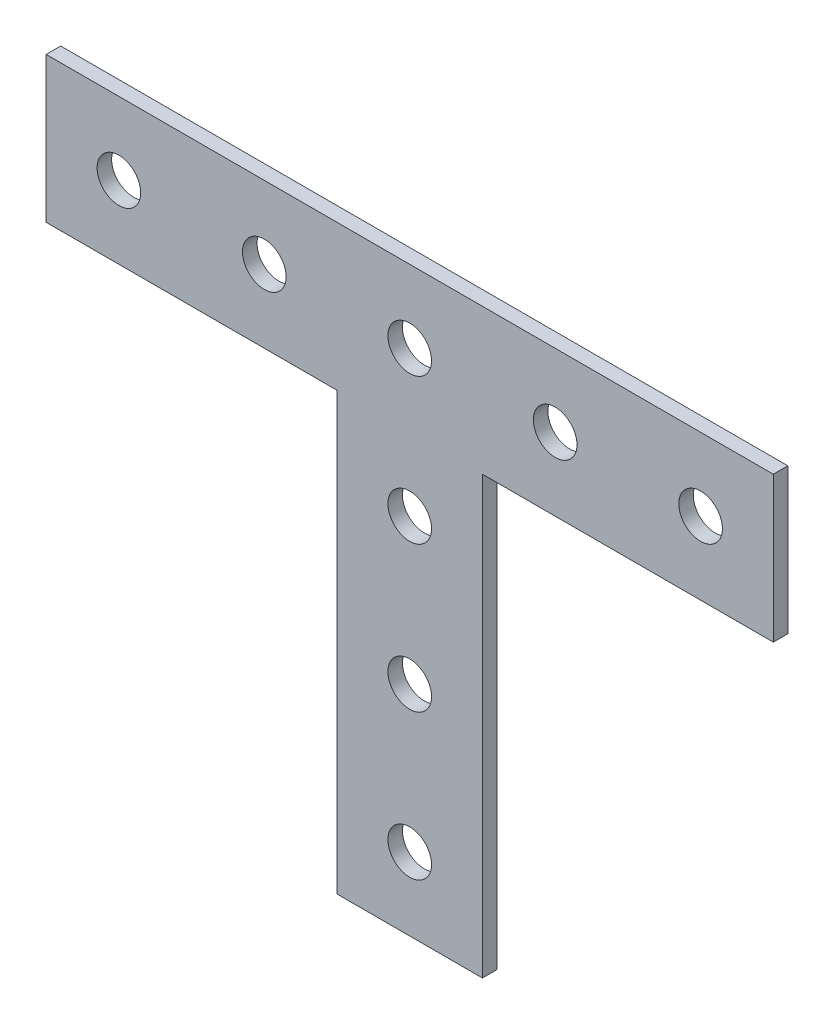
ISO-10303-21;
HEADER;
FILE_DESCRIPTION(('STEP AP214'),'2;1');
FILE_NAME('part.step','',(''),(''),'','','');
FILE_SCHEMA(('AUTOMOTIVE_DESIGN { 1 0 10303 214 1 1 1 1 }'));
ENDSEC;
DATA;
#1=APPLICATION_CONTEXT('core data for automotive mechanical design processes');
#2=APPLICATION_PROTOCOL_DEFINITION('international standard','automotive_design',2000,#1);
#3=PRODUCT_CONTEXT('',#1,'mechanical');
#4=PRODUCT('Part','Part','',(#3));
#5=PRODUCT_RELATED_PRODUCT_CATEGORY('part','',(#4));
#6=PRODUCT_DEFINITION_FORMATION('','',#4);
#7=PRODUCT_DEFINITION_CONTEXT('part definition',#1,'design');
#8=PRODUCT_DEFINITION('design','',#6,#7);
#9=PRODUCT_DEFINITION_SHAPE('','',#8);
#10=(LENGTH_UNIT() NAMED_UNIT(*) SI_UNIT(.MILLI.,.METRE.));
#11=(NAMED_UNIT(*) PLANE_ANGLE_UNIT() SI_UNIT($,.RADIAN.));
#12=(NAMED_UNIT(*) SI_UNIT($,.STERADIAN.) SOLID_ANGLE_UNIT());
#13=UNCERTAINTY_MEASURE_WITH_UNIT(LENGTH_MEASURE(1.E-05),#10,'distance_accuracy_value','');
#14=(GEOMETRIC_REPRESENTATION_CONTEXT(3) GLOBAL_UNCERTAINTY_ASSIGNED_CONTEXT((#13)) GLOBAL_UNIT_ASSIGNED_CONTEXT((#10,
#11,#12)) REPRESENTATION_CONTEXT('',''));
#15=CARTESIAN_POINT('',(0.,0.,0.));
#16=DIRECTION('',(0.,0.,1.));
#17=DIRECTION('',(1.,0.,0.));
#18=AXIS2_PLACEMENT_3D('',#15,#16,#17);
#19=CARTESIAN_POINT('',(0.,-25.,0.));
#20=DIRECTION('',(0.,0.,1.));
#21=DIRECTION('',(1.,0.,0.));
#22=AXIS2_PLACEMENT_3D('',#19,#20,#21);
#23=CYLINDRICAL_SURFACE('',#22,1.5);
#24=CARTESIAN_POINT('',(0.,-25.,0.));
#25=DIRECTION('',(0.,0.,1.));
#26=DIRECTION('',(1.,0.,0.));
#27=AXIS2_PLACEMENT_3D('',#24,#25,#26);
#28=CIRCLE('',#27,1.5);
#29=CARTESIAN_POINT('',(1.5,-25.,0.));
#30=VERTEX_POINT('',#29);
#31=EDGE_CURVE('E41',#30,#30,#28,.T.);
#32=ORIENTED_EDGE('',*,*,#31,.F.);
#33=EDGE_LOOP('',(#32));
#34=FACE_BOUND('',#33,.T.);
#35=CARTESIAN_POINT('',(0.,-25.,1.));
#36=DIRECTION('',(0.,0.,1.));
#37=DIRECTION('',(1.,0.,0.));
#38=AXIS2_PLACEMENT_3D('',#35,#36,#37);
#39=CIRCLE('',#38,1.5);
#40=CARTESIAN_POINT('',(1.5,-25.,1.));
#41=VERTEX_POINT('',#40);
#42=EDGE_CURVE('E11',#41,#41,#39,.T.);
#43=ORIENTED_EDGE('',*,*,#42,.T.);
#44=EDGE_LOOP('',(#43));
#45=FACE_BOUND('',#44,.T.);
#46=ADVANCED_FACE('F33',(#34,#45),#23,.F.);
#47=CARTESIAN_POINT('',(0.,-15.,0.));
#48=DIRECTION('',(0.,0.,1.));
#49=DIRECTION('',(1.,0.,0.));
#50=AXIS2_PLACEMENT_3D('',#47,#48,#49);
#51=CYLINDRICAL_SURFACE('',#50,1.5);
#52=CARTESIAN_POINT('',(0.,-15.,0.));
#53=DIRECTION('',(0.,0.,1.));
#54=DIRECTION('',(1.,0.,0.));
#55=AXIS2_PLACEMENT_3D('',#52,#53,#54);
#56=CIRCLE('',#55,1.5);
#57=CARTESIAN_POINT('',(1.5,-15.,0.));
#58=VERTEX_POINT('',#57);
#59=EDGE_CURVE('E173',#58,#58,#56,.T.);
#60=ORIENTED_EDGE('',*,*,#59,.F.);
#61=EDGE_LOOP('',(#60));
#62=FACE_BOUND('',#61,.T.);
#63=CARTESIAN_POINT('',(0.,-15.,1.));
#64=DIRECTION('',(0.,0.,1.));
#65=DIRECTION('',(1.,0.,0.));
#66=AXIS2_PLACEMENT_3D('',#63,#64,#65);
#67=CIRCLE('',#66,1.5);
#68=CARTESIAN_POINT('',(1.5,-15.,1.));
#69=VERTEX_POINT('',#68);
#70=EDGE_CURVE('E176',#69,#69,#67,.T.);
#71=ORIENTED_EDGE('',*,*,#70,.T.);
#72=EDGE_LOOP('',(#71));
#73=FACE_BOUND('',#72,.T.);
#74=ADVANCED_FACE('F185',(#62,#73),#51,.F.);
#75=CARTESIAN_POINT('',(20.,5.,0.));
#76=DIRECTION('',(0.,0.,1.));
#77=DIRECTION('',(1.,0.,0.));
#78=AXIS2_PLACEMENT_3D('',#75,#76,#77);
#79=CYLINDRICAL_SURFACE('',#78,1.5);
#80=CARTESIAN_POINT('',(20.,5.,0.));
#81=DIRECTION('',(0.,0.,1.));
#82=DIRECTION('',(1.,0.,0.));
#83=AXIS2_PLACEMENT_3D('',#80,#81,#82);
#84=CIRCLE('',#83,1.5);
#85=CARTESIAN_POINT('',(21.5,5.,0.));
#86=VERTEX_POINT('',#85);
#87=EDGE_CURVE('E167',#86,#86,#84,.T.);
#88=ORIENTED_EDGE('',*,*,#87,.F.);
#89=EDGE_LOOP('',(#88));
#90=FACE_BOUND('',#89,.T.);
#91=CARTESIAN_POINT('',(20.,5.,1.));
#92=DIRECTION('',(0.,0.,1.));
#93=DIRECTION('',(1.,0.,0.));
#94=AXIS2_PLACEMENT_3D('',#91,#92,#93);
#95=CIRCLE('',#94,1.5);
#96=CARTESIAN_POINT('',(21.5,5.,1.));
#97=VERTEX_POINT('',#96);
#98=EDGE_CURVE('E170',#97,#97,#95,.T.);
#99=ORIENTED_EDGE('',*,*,#98,.T.);
#100=EDGE_LOOP('',(#99));
#101=FACE_BOUND('',#100,.T.);
#102=ADVANCED_FACE('F231',(#90,#101),#79,.F.);
#103=CARTESIAN_POINT('',(-20.,5.,0.));
#104=DIRECTION('',(0.,0.,1.));
#105=DIRECTION('',(1.,0.,0.));
#106=AXIS2_PLACEMENT_3D('',#103,#104,#105);
#107=CYLINDRICAL_SURFACE('',#106,1.5);
#108=CARTESIAN_POINT('',(-20.,5.,0.));
#109=DIRECTION('',(0.,0.,1.));
#110=DIRECTION('',(1.,0.,0.));
#111=AXIS2_PLACEMENT_3D('',#108,#109,#110);
#112=CIRCLE('',#111,1.5);
#113=CARTESIAN_POINT('',(-18.5,5.,0.));
#114=VERTEX_POINT('',#113);
#115=EDGE_CURVE('E161',#114,#114,#112,.T.);
#116=ORIENTED_EDGE('',*,*,#115,.F.);
#117=EDGE_LOOP('',(#116));
#118=FACE_BOUND('',#117,.T.);
#119=CARTESIAN_POINT('',(-20.,5.,1.));
#120=DIRECTION('',(0.,0.,1.));
#121=DIRECTION('',(1.,0.,0.));
#122=AXIS2_PLACEMENT_3D('',#119,#120,#121);
#123=CIRCLE('',#122,1.5);
#124=CARTESIAN_POINT('',(-18.5,5.,1.));
#125=VERTEX_POINT('',#124);
#126=EDGE_CURVE('E164',#125,#125,#123,.T.);
#127=ORIENTED_EDGE('',*,*,#126,.T.);
#128=EDGE_LOOP('',(#127));
#129=FACE_BOUND('',#128,.T.);
#130=ADVANCED_FACE('F227',(#118,#129),#107,.F.);
#131=CARTESIAN_POINT('',(-25.,0.,1.));
#132=DIRECTION('',(1.,0.,0.));
#133=DIRECTION('',(0.,0.,-1.));
#134=AXIS2_PLACEMENT_3D('',#131,#132,#133);
#135=PLANE('',#134);
#136=DIRECTION('',(0.,-1.,0.));
#137=VECTOR('',#136,1.);
#138=CARTESIAN_POINT('',(-25.,0.,0.));
#139=LINE('',#138,#137);
#140=CARTESIAN_POINT('',(-25.,10.,0.));
#141=VERTEX_POINT('',#140);
#142=CARTESIAN_POINT('',(-25.,0.,0.));
#143=VERTEX_POINT('',#142);
#144=EDGE_CURVE('E131',#141,#143,#139,.T.);
#145=ORIENTED_EDGE('',*,*,#144,.T.);
#146=DIRECTION('',(0.,0.,-1.));
#147=VECTOR('',#146,1.);
#148=CARTESIAN_POINT('',(-25.,0.,1.));
#149=LINE('',#148,#147);
#150=CARTESIAN_POINT('',(-25.,0.,1.));
#151=VERTEX_POINT('',#150);
#152=EDGE_CURVE('E159',#151,#143,#149,.T.);
#153=ORIENTED_EDGE('',*,*,#152,.F.);
#154=DIRECTION('',(0.,-1.,0.));
#155=VECTOR('',#154,1.);
#156=CARTESIAN_POINT('',(-25.,0.,1.));
#157=LINE('',#156,#155);
#158=CARTESIAN_POINT('',(-25.,10.,1.));
#159=VERTEX_POINT('',#158);
#160=EDGE_CURVE('E146',#159,#151,#157,.T.);
#161=ORIENTED_EDGE('',*,*,#160,.F.);
#162=DIRECTION('',(0.,0.,-1.));
#163=VECTOR('',#162,1.);
#164=CARTESIAN_POINT('',(-25.,10.,1.));
#165=LINE('',#164,#163);
#166=EDGE_CURVE('E127',#159,#141,#165,.T.);
#167=ORIENTED_EDGE('',*,*,#166,.T.);
#168=EDGE_LOOP('',(#145,#153,#161,#167));
#169=FACE_BOUND('',#168,.T.);
#170=ADVANCED_FACE('F224',(#169),#135,.F.);
#171=CARTESIAN_POINT('',(-5.,0.,1.));
#172=DIRECTION('',(0.,1.,0.));
#173=DIRECTION('',(-1.,0.,0.));
#174=AXIS2_PLACEMENT_3D('',#171,#172,#173);
#175=PLANE('',#174);
#176=DIRECTION('',(1.,0.,0.));
#177=VECTOR('',#176,1.);
#178=CARTESIAN_POINT('',(-5.,0.,0.));
#179=LINE('',#178,#177);
#180=CARTESIAN_POINT('',(-5.,0.,0.));
#181=VERTEX_POINT('',#180);
#182=EDGE_CURVE('E134',#143,#181,#179,.T.);
#183=ORIENTED_EDGE('',*,*,#182,.T.);
#184=DIRECTION('',(0.,0.,-1.));
#185=VECTOR('',#184,1.);
#186=CARTESIAN_POINT('',(-5.,0.,1.));
#187=LINE('',#186,#185);
#188=CARTESIAN_POINT('',(-5.,0.,1.));
#189=VERTEX_POINT('',#188);
#190=EDGE_CURVE('E156',#189,#181,#187,.T.);
#191=ORIENTED_EDGE('',*,*,#190,.F.);
#192=DIRECTION('',(1.,0.,0.));
#193=VECTOR('',#192,1.);
#194=CARTESIAN_POINT('',(-5.,0.,1.));
#195=LINE('',#194,#193);
#196=EDGE_CURVE('E93',#151,#189,#195,.T.);
#197=ORIENTED_EDGE('',*,*,#196,.F.);
#198=ORIENTED_EDGE('',*,*,#152,.T.);
#199=EDGE_LOOP('',(#183,#191,#197,#198));
#200=FACE_BOUND('',#199,.T.);
#201=ADVANCED_FACE('F220',(#200),#175,.F.);
#202=CARTESIAN_POINT('',(-5.,-30.,1.));
#203=DIRECTION('',(1.,0.,0.));
#204=DIRECTION('',(0.,0.,-1.));
#205=AXIS2_PLACEMENT_3D('',#202,#203,#204);
#206=PLANE('',#205);
#207=DIRECTION('',(0.,-1.,0.));
#208=VECTOR('',#207,1.);
#209=CARTESIAN_POINT('',(-5.,-30.,0.));
#210=LINE('',#209,#208);
#211=CARTESIAN_POINT('',(-5.,-30.,0.));
#212=VERTEX_POINT('',#211);
#213=EDGE_CURVE('E137',#181,#212,#210,.T.);
#214=ORIENTED_EDGE('',*,*,#213,.T.);
#215=DIRECTION('',(0.,0.,-1.));
#216=VECTOR('',#215,1.);
#217=CARTESIAN_POINT('',(-5.,-30.,1.));
#218=LINE('',#217,#216);
#219=CARTESIAN_POINT('',(-5.,-30.,1.));
#220=VERTEX_POINT('',#219);
#221=EDGE_CURVE('E153',#220,#212,#218,.T.);
#222=ORIENTED_EDGE('',*,*,#221,.F.);
#223=DIRECTION('',(0.,-1.,0.));
#224=VECTOR('',#223,1.);
#225=CARTESIAN_POINT('',(-5.,-30.,1.));
#226=LINE('',#225,#224);
#227=EDGE_CURVE('E375',#189,#220,#226,.T.);
#228=ORIENTED_EDGE('',*,*,#227,.F.);
#229=ORIENTED_EDGE('',*,*,#190,.T.);
#230=EDGE_LOOP('',(#214,#222,#228,#229));
#231=FACE_BOUND('',#230,.T.);
#232=ADVANCED_FACE('F216',(#231),#206,.F.);
#233=CARTESIAN_POINT('',(5.,-30.,1.));
#234=DIRECTION('',(0.,1.,0.));
#235=DIRECTION('',(0.,0.,1.));
#236=AXIS2_PLACEMENT_3D('',#233,#234,#235);
#237=PLANE('',#236);
#238=DIRECTION('',(1.,0.,0.));
#239=VECTOR('',#238,1.);
#240=CARTESIAN_POINT('',(5.,-30.,0.));
#241=LINE('',#240,#239);
#242=CARTESIAN_POINT('',(5.,-30.,0.));
#243=VERTEX_POINT('',#242);
#244=EDGE_CURVE('E139',#212,#243,#241,.T.);
#245=ORIENTED_EDGE('',*,*,#244,.T.);
#246=DIRECTION('',(0.,0.,-1.));
#247=VECTOR('',#246,1.);
#248=CARTESIAN_POINT('',(5.,-30.,1.));
#249=LINE('',#248,#247);
#250=CARTESIAN_POINT('',(5.,-30.,1.));
#251=VERTEX_POINT('',#250);
#252=EDGE_CURVE('E150',#251,#243,#249,.T.);
#253=ORIENTED_EDGE('',*,*,#252,.F.);
#254=DIRECTION('',(1.,0.,0.));
#255=VECTOR('',#254,1.);
#256=CARTESIAN_POINT('',(5.,-30.,1.));
#257=LINE('',#256,#255);
#258=EDGE_CURVE('E377',#220,#251,#257,.T.);
#259=ORIENTED_EDGE('',*,*,#258,.F.);
#260=ORIENTED_EDGE('',*,*,#221,.T.);
#261=EDGE_LOOP('',(#245,#253,#259,#260));
#262=FACE_BOUND('',#261,.T.);
#263=ADVANCED_FACE('F212',(#262),#237,.F.);
#264=CARTESIAN_POINT('',(5.,0.,1.));
#265=DIRECTION('',(-1.,0.,0.));
#266=DIRECTION('',(0.,0.,1.));
#267=AXIS2_PLACEMENT_3D('',#264,#265,#266);
#268=PLANE('',#267);
#269=DIRECTION('',(0.,1.,0.));
#270=VECTOR('',#269,1.);
#271=CARTESIAN_POINT('',(5.,0.,0.));
#272=LINE('',#271,#270);
#273=CARTESIAN_POINT('',(5.,0.,0.));
#274=VERTEX_POINT('',#273);
#275=EDGE_CURVE('E141',#243,#274,#272,.T.);
#276=ORIENTED_EDGE('',*,*,#275,.T.);
#277=DIRECTION('',(0.,0.,-1.));
#278=VECTOR('',#277,1.);
#279=CARTESIAN_POINT('',(5.,0.,1.));
#280=LINE('',#279,#278);
#281=CARTESIAN_POINT('',(5.,0.,1.));
#282=VERTEX_POINT('',#281);
#283=EDGE_CURVE('E122',#282,#274,#280,.T.);
#284=ORIENTED_EDGE('',*,*,#283,.F.);
#285=DIRECTION('',(0.,1.,0.));
#286=VECTOR('',#285,1.);
#287=CARTESIAN_POINT('',(5.,0.,1.));
#288=LINE('',#287,#286);
#289=EDGE_CURVE('E113',#251,#282,#288,.T.);
#290=ORIENTED_EDGE('',*,*,#289,.F.);
#291=ORIENTED_EDGE('',*,*,#252,.T.);
#292=EDGE_LOOP('',(#276,#284,#290,#291));
#293=FACE_BOUND('',#292,.T.);
#294=ADVANCED_FACE('F209',(#293),#268,.F.);
#295=CARTESIAN_POINT('',(25.,0.,1.));
#296=DIRECTION('',(0.,1.,0.));
#297=DIRECTION('',(-1.,0.,0.));
#298=AXIS2_PLACEMENT_3D('',#295,#296,#297);
#299=PLANE('',#298);
#300=DIRECTION('',(1.,0.,0.));
#301=VECTOR('',#300,1.);
#302=CARTESIAN_POINT('',(25.,0.,0.));
#303=LINE('',#302,#301);
#304=CARTESIAN_POINT('',(25.,0.,0.));
#305=VERTEX_POINT('',#304);
#306=EDGE_CURVE('E121',#274,#305,#303,.T.);
#307=ORIENTED_EDGE('',*,*,#306,.T.);
#308=DIRECTION('',(0.,0.,-1.));
#309=VECTOR('',#308,1.);
#310=CARTESIAN_POINT('',(25.,0.,1.));
#311=LINE('',#310,#309);
#312=CARTESIAN_POINT('',(25.,0.,1.));
#313=VERTEX_POINT('',#312);
#314=EDGE_CURVE('E118',#313,#305,#311,.T.);
#315=ORIENTED_EDGE('',*,*,#314,.F.);
#316=DIRECTION('',(1.,0.,0.));
#317=VECTOR('',#316,1.);
#318=CARTESIAN_POINT('',(25.,0.,1.));
#319=LINE('',#318,#317);
#320=EDGE_CURVE('E106',#282,#313,#319,.T.);
#321=ORIENTED_EDGE('',*,*,#320,.F.);
#322=ORIENTED_EDGE('',*,*,#283,.T.);
#323=EDGE_LOOP('',(#307,#315,#321,#322));
#324=FACE_BOUND('',#323,.T.);
#325=ADVANCED_FACE('F119',(#324),#299,.F.);
#326=CARTESIAN_POINT('',(25.,10.,1.));
#327=DIRECTION('',(-1.,0.,0.));
#328=DIRECTION('',(0.,0.,1.));
#329=AXIS2_PLACEMENT_3D('',#326,#327,#328);
#330=PLANE('',#329);
#331=DIRECTION('',(0.,1.,0.));
#332=VECTOR('',#331,1.);
#333=CARTESIAN_POINT('',(25.,10.,0.));
#334=LINE('',#333,#332);
#335=CARTESIAN_POINT('',(25.,10.,0.));
#336=VERTEX_POINT('',#335);
#337=EDGE_CURVE('E78',#305,#336,#334,.T.);
#338=ORIENTED_EDGE('',*,*,#337,.T.);
#339=DIRECTION('',(0.,0.,-1.));
#340=VECTOR('',#339,1.);
#341=CARTESIAN_POINT('',(25.,10.,1.));
#342=LINE('',#341,#340);
#343=CARTESIAN_POINT('',(25.,10.,1.));
#344=VERTEX_POINT('',#343);
#345=EDGE_CURVE('E123',#344,#336,#342,.T.);
#346=ORIENTED_EDGE('',*,*,#345,.F.);
#347=DIRECTION('',(0.,1.,0.));
#348=VECTOR('',#347,1.);
#349=CARTESIAN_POINT('',(25.,10.,1.));
#350=LINE('',#349,#348);
#351=EDGE_CURVE('E111',#313,#344,#350,.T.);
#352=ORIENTED_EDGE('',*,*,#351,.F.);
#353=ORIENTED_EDGE('',*,*,#314,.T.);
#354=EDGE_LOOP('',(#338,#346,#352,#353));
#355=FACE_BOUND('',#354,.T.);
#356=ADVANCED_FACE('F125',(#355),#330,.F.);
#357=CARTESIAN_POINT('',(-25.,10.,1.));
#358=DIRECTION('',(0.,-1.,0.));
#359=DIRECTION('',(0.,0.,-1.));
#360=AXIS2_PLACEMENT_3D('',#357,#358,#359);
#361=PLANE('',#360);
#362=DIRECTION('',(-1.,0.,0.));
#363=VECTOR('',#362,1.);
#364=CARTESIAN_POINT('',(-25.,10.,0.));
#365=LINE('',#364,#363);
#366=EDGE_CURVE('E84',#336,#141,#365,.T.);
#367=ORIENTED_EDGE('',*,*,#366,.T.);
#368=ORIENTED_EDGE('',*,*,#166,.F.);
#369=DIRECTION('',(-1.,0.,0.));
#370=VECTOR('',#369,1.);
#371=CARTESIAN_POINT('',(-25.,10.,1.));
#372=LINE('',#371,#370);
#373=EDGE_CURVE('E49',#344,#159,#372,.T.);
#374=ORIENTED_EDGE('',*,*,#373,.F.);
#375=ORIENTED_EDGE('',*,*,#345,.T.);
#376=EDGE_LOOP('',(#367,#368,#374,#375));
#377=FACE_BOUND('',#376,.T.);
#378=ADVANCED_FACE('F189',(#377),#361,.F.);
#379=CARTESIAN_POINT('',(0.,0.,1.));
#380=DIRECTION('',(0.,0.,-1.));
#381=DIRECTION('',(-1.,0.,0.));
#382=AXIS2_PLACEMENT_3D('',#379,#380,#381);
#383=PLANE('',#382);
#384=CARTESIAN_POINT('',(0.,-5.,1.));
#385=DIRECTION('',(0.,0.,1.));
#386=DIRECTION('',(1.,0.,0.));
#387=AXIS2_PLACEMENT_3D('',#384,#385,#386);
#388=CIRCLE('',#387,1.5);
#389=CARTESIAN_POINT('',(1.5,-5.,1.));
#390=VERTEX_POINT('',#389);
#391=EDGE_CURVE('E352',#390,#390,#388,.T.);
#392=ORIENTED_EDGE('',*,*,#391,.F.);
#393=EDGE_LOOP('',(#392));
#394=FACE_BOUND('',#393,.T.);
#395=CARTESIAN_POINT('',(10.,5.,1.));
#396=DIRECTION('',(0.,0.,1.));
#397=DIRECTION('',(1.,0.,0.));
#398=AXIS2_PLACEMENT_3D('',#395,#396,#397);
#399=CIRCLE('',#398,1.5);
#400=CARTESIAN_POINT('',(11.5,5.,1.));
#401=VERTEX_POINT('',#400);
#402=EDGE_CURVE('E356',#401,#401,#399,.T.);
#403=ORIENTED_EDGE('',*,*,#402,.F.);
#404=EDGE_LOOP('',(#403));
#405=FACE_BOUND('',#404,.T.);
#406=CARTESIAN_POINT('',(-10.,5.,1.));
#407=DIRECTION('',(0.,0.,1.));
#408=DIRECTION('',(1.,0.,0.));
#409=AXIS2_PLACEMENT_3D('',#406,#407,#408);
#410=CIRCLE('',#409,1.5);
#411=CARTESIAN_POINT('',(-8.5,5.,1.));
#412=VERTEX_POINT('',#411);
#413=EDGE_CURVE('E365',#412,#412,#410,.T.);
#414=ORIENTED_EDGE('',*,*,#413,.F.);
#415=EDGE_LOOP('',(#414));
#416=FACE_BOUND('',#415,.T.);
#417=CARTESIAN_POINT('',(0.,5.,1.));
#418=DIRECTION('',(0.,0.,1.));
#419=DIRECTION('',(1.,0.,0.));
#420=AXIS2_PLACEMENT_3D('',#417,#418,#419);
#421=CIRCLE('',#420,1.5);
#422=CARTESIAN_POINT('',(1.5,5.,1.));
#423=VERTEX_POINT('',#422);
#424=EDGE_CURVE('E368',#423,#423,#421,.T.);
#425=ORIENTED_EDGE('',*,*,#424,.F.);
#426=EDGE_LOOP('',(#425));
#427=FACE_BOUND('',#426,.T.);
#428=ORIENTED_EDGE('',*,*,#160,.T.);
#429=ORIENTED_EDGE('',*,*,#196,.T.);
#430=ORIENTED_EDGE('',*,*,#227,.T.);
#431=ORIENTED_EDGE('',*,*,#258,.T.);
#432=ORIENTED_EDGE('',*,*,#289,.T.);
#433=ORIENTED_EDGE('',*,*,#320,.T.);
#434=ORIENTED_EDGE('',*,*,#351,.T.);
#435=ORIENTED_EDGE('',*,*,#373,.T.);
#436=EDGE_LOOP('',(#428,#429,#430,#431,#432,#433,#434,#435));
#437=FACE_BOUND('',#436,.T.);
#438=ORIENTED_EDGE('',*,*,#126,.F.);
#439=EDGE_LOOP('',(#438));
#440=FACE_BOUND('',#439,.T.);
#441=ORIENTED_EDGE('',*,*,#98,.F.);
#442=EDGE_LOOP('',(#441));
#443=FACE_BOUND('',#442,.T.);
#444=ORIENTED_EDGE('',*,*,#70,.F.);
#445=EDGE_LOOP('',(#444));
#446=FACE_BOUND('',#445,.T.);
#447=ORIENTED_EDGE('',*,*,#42,.F.);
#448=EDGE_LOOP('',(#447));
#449=FACE_BOUND('',#448,.T.);
#450=ADVANCED_FACE('F108',(#394,#405,#416,#427,#437,#440,#443,#446,#449),#383,.F.);
#451=CARTESIAN_POINT('',(0.,0.,0.));
#452=DIRECTION('',(0.,0.,-1.));
#453=DIRECTION('',(-1.,0.,0.));
#454=AXIS2_PLACEMENT_3D('',#451,#452,#453);
#455=PLANE('',#454);
#456=CARTESIAN_POINT('',(0.,-5.,0.));
#457=DIRECTION('',(0.,0.,1.));
#458=DIRECTION('',(1.,0.,0.));
#459=AXIS2_PLACEMENT_3D('',#456,#457,#458);
#460=CIRCLE('',#459,1.5);
#461=CARTESIAN_POINT('',(1.5,-5.,0.));
#462=VERTEX_POINT('',#461);
#463=EDGE_CURVE('E350',#462,#462,#460,.T.);
#464=ORIENTED_EDGE('',*,*,#463,.T.);
#465=EDGE_LOOP('',(#464));
#466=FACE_BOUND('',#465,.T.);
#467=CARTESIAN_POINT('',(10.,5.,0.));
#468=DIRECTION('',(0.,0.,1.));
#469=DIRECTION('',(1.,0.,0.));
#470=AXIS2_PLACEMENT_3D('',#467,#468,#469);
#471=CIRCLE('',#470,1.5);
#472=CARTESIAN_POINT('',(11.5,5.,0.));
#473=VERTEX_POINT('',#472);
#474=EDGE_CURVE('E353',#473,#473,#471,.T.);
#475=ORIENTED_EDGE('',*,*,#474,.T.);
#476=EDGE_LOOP('',(#475));
#477=FACE_BOUND('',#476,.T.);
#478=CARTESIAN_POINT('',(-10.,5.,0.));
#479=DIRECTION('',(0.,0.,1.));
#480=DIRECTION('',(1.,0.,0.));
#481=AXIS2_PLACEMENT_3D('',#478,#479,#480);
#482=CIRCLE('',#481,1.5);
#483=CARTESIAN_POINT('',(-8.5,5.,0.));
#484=VERTEX_POINT('',#483);
#485=EDGE_CURVE('E362',#484,#484,#482,.T.);
#486=ORIENTED_EDGE('',*,*,#485,.T.);
#487=EDGE_LOOP('',(#486));
#488=FACE_BOUND('',#487,.T.);
#489=CARTESIAN_POINT('',(0.,5.,0.));
#490=DIRECTION('',(0.,0.,1.));
#491=DIRECTION('',(1.,0.,0.));
#492=AXIS2_PLACEMENT_3D('',#489,#490,#491);
#493=CIRCLE('',#492,1.5);
#494=CARTESIAN_POINT('',(1.5,5.,0.));
#495=VERTEX_POINT('',#494);
#496=EDGE_CURVE('E135',#495,#495,#493,.T.);
#497=ORIENTED_EDGE('',*,*,#496,.T.);
#498=EDGE_LOOP('',(#497));
#499=FACE_BOUND('',#498,.T.);
#500=ORIENTED_EDGE('',*,*,#144,.F.);
#501=ORIENTED_EDGE('',*,*,#366,.F.);
#502=ORIENTED_EDGE('',*,*,#337,.F.);
#503=ORIENTED_EDGE('',*,*,#306,.F.);
#504=ORIENTED_EDGE('',*,*,#275,.F.);
#505=ORIENTED_EDGE('',*,*,#244,.F.);
#506=ORIENTED_EDGE('',*,*,#213,.F.);
#507=ORIENTED_EDGE('',*,*,#182,.F.);
#508=EDGE_LOOP('',(#500,#501,#502,#503,#504,#505,#506,#507));
#509=FACE_BOUND('',#508,.T.);
#510=ORIENTED_EDGE('',*,*,#115,.T.);
#511=EDGE_LOOP('',(#510));
#512=FACE_BOUND('',#511,.T.);
#513=ORIENTED_EDGE('',*,*,#87,.T.);
#514=EDGE_LOOP('',(#513));
#515=FACE_BOUND('',#514,.T.);
#516=ORIENTED_EDGE('',*,*,#59,.T.);
#517=EDGE_LOOP('',(#516));
#518=FACE_BOUND('',#517,.T.);
#519=ORIENTED_EDGE('',*,*,#31,.T.);
#520=EDGE_LOOP('',(#519));
#521=FACE_BOUND('',#520,.T.);
#522=ADVANCED_FACE('F181',(#466,#477,#488,#499,#509,#512,#515,#518,#521),#455,.T.);
#523=CARTESIAN_POINT('',(0.,5.,0.));
#524=DIRECTION('',(0.,0.,1.));
#525=DIRECTION('',(1.,0.,0.));
#526=AXIS2_PLACEMENT_3D('',#523,#524,#525);
#527=CYLINDRICAL_SURFACE('',#526,1.5);
#528=ORIENTED_EDGE('',*,*,#496,.F.);
#529=EDGE_LOOP('',(#528));
#530=FACE_BOUND('',#529,.T.);
#531=ORIENTED_EDGE('',*,*,#424,.T.);
#532=EDGE_LOOP('',(#531));
#533=FACE_BOUND('',#532,.T.);
#534=ADVANCED_FACE('F196',(#530,#533),#527,.F.);
#535=CARTESIAN_POINT('',(-10.,5.,0.));
#536=DIRECTION('',(0.,0.,1.));
#537=DIRECTION('',(1.,0.,0.));
#538=AXIS2_PLACEMENT_3D('',#535,#536,#537);
#539=CYLINDRICAL_SURFACE('',#538,1.5);
#540=ORIENTED_EDGE('',*,*,#485,.F.);
#541=EDGE_LOOP('',(#540));
#542=FACE_BOUND('',#541,.T.);
#543=ORIENTED_EDGE('',*,*,#413,.T.);
#544=EDGE_LOOP('',(#543));
#545=FACE_BOUND('',#544,.T.);
#546=ADVANCED_FACE('F297',(#542,#545),#539,.F.);
#547=CARTESIAN_POINT('',(10.,5.,0.));
#548=DIRECTION('',(0.,0.,1.));
#549=DIRECTION('',(1.,0.,0.));
#550=AXIS2_PLACEMENT_3D('',#547,#548,#549);
#551=CYLINDRICAL_SURFACE('',#550,1.5);
#552=ORIENTED_EDGE('',*,*,#474,.F.);
#553=EDGE_LOOP('',(#552));
#554=FACE_BOUND('',#553,.T.);
#555=ORIENTED_EDGE('',*,*,#402,.T.);
#556=EDGE_LOOP('',(#555));
#557=FACE_BOUND('',#556,.T.);
#558=ADVANCED_FACE('F308',(#554,#557),#551,.F.);
#559=CARTESIAN_POINT('',(0.,-5.,0.));
#560=DIRECTION('',(0.,0.,1.));
#561=DIRECTION('',(1.,0.,0.));
#562=AXIS2_PLACEMENT_3D('',#559,#560,#561);
#563=CYLINDRICAL_SURFACE('',#562,1.5);
#564=ORIENTED_EDGE('',*,*,#463,.F.);
#565=EDGE_LOOP('',(#564));
#566=FACE_BOUND('',#565,.T.);
#567=ORIENTED_EDGE('',*,*,#391,.T.);
#568=EDGE_LOOP('',(#567));
#569=FACE_BOUND('',#568,.T.);
#570=ADVANCED_FACE('F314',(#566,#569),#563,.F.);
#571=CLOSED_SHELL('',(#46,#74,#102,#130,#170,#201,#232,#263,#294,#325,#356,#378,#450,#522,#534,
#546,#558,#570));
#572=MANIFOLD_SOLID_BREP('B2',#571);
#573=ADVANCED_BREP_SHAPE_REPRESENTATION('',(#18,#572),#14);
#574=SHAPE_DEFINITION_REPRESENTATION(#9,#573);
ENDSEC;
END-ISO-10303-21;
